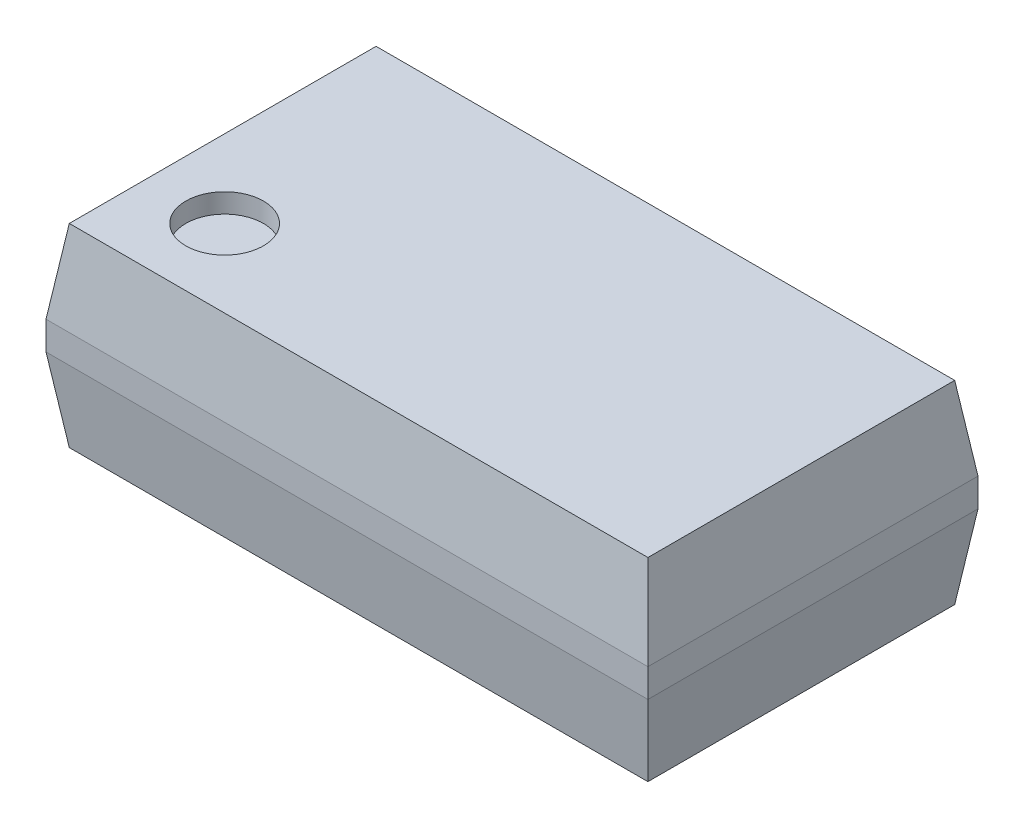
ISO-10303-21;
HEADER;
FILE_DESCRIPTION(('STEP AP214'),'2;1');
FILE_NAME('part.step','',(''),(''),'','','');
FILE_SCHEMA(('AUTOMOTIVE_DESIGN { 1 0 10303 214 1 1 1 1 }'));
ENDSEC;
DATA;
#1=APPLICATION_CONTEXT('core data for automotive mechanical design processes');
#2=APPLICATION_PROTOCOL_DEFINITION('international standard','automotive_design',2000,#1);
#3=PRODUCT_CONTEXT('',#1,'mechanical');
#4=PRODUCT('Part','Part','',(#3));
#5=PRODUCT_RELATED_PRODUCT_CATEGORY('part','',(#4));
#6=PRODUCT_DEFINITION_FORMATION('','',#4);
#7=PRODUCT_DEFINITION_CONTEXT('part definition',#1,'design');
#8=PRODUCT_DEFINITION('design','',#6,#7);
#9=PRODUCT_DEFINITION_SHAPE('','',#8);
#10=(LENGTH_UNIT() NAMED_UNIT(*) SI_UNIT(.MILLI.,.METRE.));
#11=(NAMED_UNIT(*) PLANE_ANGLE_UNIT() SI_UNIT($,.RADIAN.));
#12=(NAMED_UNIT(*) SI_UNIT($,.STERADIAN.) SOLID_ANGLE_UNIT());
#13=UNCERTAINTY_MEASURE_WITH_UNIT(LENGTH_MEASURE(1.E-05),#10,'distance_accuracy_value','');
#14=(GEOMETRIC_REPRESENTATION_CONTEXT(3) GLOBAL_UNCERTAINTY_ASSIGNED_CONTEXT((#13)) GLOBAL_UNIT_ASSIGNED_CONTEXT((#10,
#11,#12)) REPRESENTATION_CONTEXT('',''));
#15=CARTESIAN_POINT('',(0.,0.,0.));
#16=DIRECTION('',(0.,0.,1.));
#17=DIRECTION('',(1.,0.,0.));
#18=AXIS2_PLACEMENT_3D('',#15,#16,#17);
#19=CARTESIAN_POINT('',(-2.64,0.9,1.24));
#20=DIRECTION('',(0.,1.,0.));
#21=DIRECTION('',(-1.,0.,0.));
#22=AXIS2_PLACEMENT_3D('',#19,#20,#21);
#23=PLANE('',#22);
#24=CARTESIAN_POINT('',(-2.64,0.9,1.24));
#25=DIRECTION('',(0.,1.,0.));
#26=DIRECTION('',(-1.,0.,0.));
#27=AXIS2_PLACEMENT_3D('',#24,#25,#26);
#28=CIRCLE('',#27,0.2);
#29=CARTESIAN_POINT('',(-2.84,0.9,1.24));
#30=VERTEX_POINT('',#29);
#31=EDGE_CURVE('E20',#30,#30,#28,.T.);
#32=ORIENTED_EDGE('',*,*,#31,.T.);
#33=EDGE_LOOP('',(#32));
#34=FACE_BOUND('',#33,.T.);
#35=ADVANCED_FACE('F17',(#34),#23,.T.);
#36=CARTESIAN_POINT('',(-2.64,0.9,1.24));
#37=DIRECTION('',(0.,1.,0.));
#38=DIRECTION('',(-1.,0.,0.));
#39=AXIS2_PLACEMENT_3D('',#36,#37,#38);
#40=CYLINDRICAL_SURFACE('',#39,0.2);
#41=ORIENTED_EDGE('',*,*,#31,.F.);
#42=EDGE_LOOP('',(#41));
#43=FACE_BOUND('',#42,.T.);
#44=CARTESIAN_POINT('',(-2.64,1.,1.24));
#45=DIRECTION('',(0.,1.,0.));
#46=DIRECTION('',(-1.,0.,0.));
#47=AXIS2_PLACEMENT_3D('',#44,#45,#46);
#48=CIRCLE('',#47,0.2);
#49=CARTESIAN_POINT('',(-2.84,1.,1.24));
#50=VERTEX_POINT('',#49);
#51=EDGE_CURVE('E107',#50,#50,#48,.T.);
#52=ORIENTED_EDGE('',*,*,#51,.T.);
#53=EDGE_LOOP('',(#52));
#54=FACE_BOUND('',#53,.T.);
#55=ADVANCED_FACE('F115',(#43,#54),#40,.F.);
#56=CARTESIAN_POINT('',(0.,1.,1.7));
#57=DIRECTION('',(0.,-1.,0.));
#58=DIRECTION('',(1.,0.,0.));
#59=AXIS2_PLACEMENT_3D('',#56,#57,#58);
#60=PLANE('',#59);
#61=DIRECTION('',(1.,0.,0.));
#62=VECTOR('',#61,1.);
#63=CARTESIAN_POINT('',(0.,1.,0.0600000000000002));
#64=LINE('',#63,#62);
#65=CARTESIAN_POINT('',(-0.0600000000000003,1.,0.0599999999999999));
#66=VERTEX_POINT('',#65);
#67=CARTESIAN_POINT('',(-3.04,1.,0.0599999999999999));
#68=VERTEX_POINT('',#67);
#69=EDGE_CURVE('E83',#66,#68,#64,.F.);
#70=ORIENTED_EDGE('',*,*,#69,.T.);
#71=DIRECTION('',(0.,0.,1.));
#72=VECTOR('',#71,1.);
#73=CARTESIAN_POINT('',(-3.04,0.999999999999999,1.7));
#74=LINE('',#73,#72);
#75=CARTESIAN_POINT('',(-3.04,1.,1.64));
#76=VERTEX_POINT('',#75);
#77=EDGE_CURVE('E80',#68,#76,#74,.T.);
#78=ORIENTED_EDGE('',*,*,#77,.T.);
#79=DIRECTION('',(1.,0.,0.));
#80=VECTOR('',#79,1.);
#81=CARTESIAN_POINT('',(0.,1.,1.64));
#82=LINE('',#81,#80);
#83=CARTESIAN_POINT('',(-0.0600000000000003,1.,1.64));
#84=VERTEX_POINT('',#83);
#85=EDGE_CURVE('E280',#84,#76,#82,.F.);
#86=ORIENTED_EDGE('',*,*,#85,.F.);
#87=DIRECTION('',(0.,0.,1.));
#88=VECTOR('',#87,1.);
#89=CARTESIAN_POINT('',(-0.0600000000000002,1.,1.7));
#90=LINE('',#89,#88);
#91=EDGE_CURVE('E86',#66,#84,#90,.T.);
#92=ORIENTED_EDGE('',*,*,#91,.F.);
#93=EDGE_LOOP('',(#70,#78,#86,#92));
#94=FACE_BOUND('',#93,.T.);
#95=ORIENTED_EDGE('',*,*,#51,.F.);
#96=EDGE_LOOP('',(#95));
#97=FACE_BOUND('',#96,.T.);
#98=ADVANCED_FACE('F84',(#94,#97),#60,.F.);
#99=CARTESIAN_POINT('',(0.,1.,0.0600000000000002));
#100=DIRECTION('',(0.,-0.139173100960066,0.99026806874157));
#101=DIRECTION('',(0.,-0.99026806874157,-0.139173100960066));
#102=AXIS2_PLACEMENT_3D('',#99,#100,#101);
#103=PLANE('',#102);
#104=DIRECTION('',(1.,0.,0.));
#105=VECTOR('',#104,1.);
#106=CARTESIAN_POINT('',(0.,0.573077816656949,0.));
#107=LINE('',#106,#105);
#108=CARTESIAN_POINT('',(0.,0.573077816656949,0.));
#109=VERTEX_POINT('',#108);
#110=CARTESIAN_POINT('',(-3.1,0.573077816656949,0.));
#111=VERTEX_POINT('',#110);
#112=EDGE_CURVE('E102',#109,#111,#107,.F.);
#113=ORIENTED_EDGE('',*,*,#112,.T.);
#114=DIRECTION('',(0.137844537491629,0.980814848463989,0.137844537491629));
#115=VECTOR('',#114,1.);
#116=CARTESIAN_POINT('',(-3.1,0.573077816656949,0.));
#117=LINE('',#116,#115);
#118=EDGE_CURVE('E91',#111,#68,#117,.T.);
#119=ORIENTED_EDGE('',*,*,#118,.T.);
#120=ORIENTED_EDGE('',*,*,#69,.F.);
#121=DIRECTION('',(0.13784453749163,-0.980814848463989,-0.137844537491629));
#122=VECTOR('',#121,1.);
#123=CARTESIAN_POINT('',(-0.0600000000000002,1.,0.0599999999999993));
#124=LINE('',#123,#122);
#125=EDGE_CURVE('E286',#66,#109,#124,.T.);
#126=ORIENTED_EDGE('',*,*,#125,.T.);
#127=EDGE_LOOP('',(#113,#119,#120,#126));
#128=FACE_BOUND('',#127,.T.);
#129=ADVANCED_FACE('F101',(#128),#103,.F.);
#130=CARTESIAN_POINT('',(-3.1,0.573077816656949,1.7));
#131=DIRECTION('',(0.99026806874157,-0.139173100960066,0.));
#132=DIRECTION('',(0.139173100960066,0.99026806874157,0.));
#133=AXIS2_PLACEMENT_3D('',#130,#131,#132);
#134=PLANE('',#133);
#135=ORIENTED_EDGE('',*,*,#77,.F.);
#136=ORIENTED_EDGE('',*,*,#118,.F.);
#137=DIRECTION('',(0.,0.,-1.));
#138=VECTOR('',#137,1.);
#139=CARTESIAN_POINT('',(-3.1,0.573077816656949,1.7));
#140=LINE('',#139,#138);
#141=CARTESIAN_POINT('',(-3.1,0.573077816656949,1.7));
#142=VERTEX_POINT('',#141);
#143=EDGE_CURVE('E288',#111,#142,#140,.F.);
#144=ORIENTED_EDGE('',*,*,#143,.T.);
#145=DIRECTION('',(-0.13784453749163,-0.980814848463989,0.137844537491629));
#146=VECTOR('',#145,1.);
#147=CARTESIAN_POINT('',(-3.04,0.999999999999999,1.64));
#148=LINE('',#147,#146);
#149=EDGE_CURVE('E98',#76,#142,#148,.T.);
#150=ORIENTED_EDGE('',*,*,#149,.F.);
#151=EDGE_LOOP('',(#135,#136,#144,#150));
#152=FACE_BOUND('',#151,.T.);
#153=ADVANCED_FACE('F95',(#152),#134,.F.);
#154=CARTESIAN_POINT('',(0.,0.573077816656949,1.7));
#155=DIRECTION('',(0.,0.139173100960066,0.99026806874157));
#156=DIRECTION('',(0.,-0.99026806874157,0.139173100960066));
#157=AXIS2_PLACEMENT_3D('',#154,#155,#156);
#158=PLANE('',#157);
#159=DIRECTION('',(-0.13784453749163,0.980814848463989,-0.137844537491629));
#160=VECTOR('',#159,1.);
#161=CARTESIAN_POINT('',(0.,0.573077816656949,1.7));
#162=LINE('',#161,#160);
#163=CARTESIAN_POINT('',(0.,0.573077816656949,1.7));
#164=VERTEX_POINT('',#163);
#165=EDGE_CURVE('E279',#164,#84,#162,.T.);
#166=ORIENTED_EDGE('',*,*,#165,.T.);
#167=ORIENTED_EDGE('',*,*,#85,.T.);
#168=ORIENTED_EDGE('',*,*,#149,.T.);
#169=DIRECTION('',(1.,0.,0.));
#170=VECTOR('',#169,1.);
#171=CARTESIAN_POINT('',(0.,0.573077816656949,1.7));
#172=LINE('',#171,#170);
#173=EDGE_CURVE('E282',#164,#142,#172,.F.);
#174=ORIENTED_EDGE('',*,*,#173,.F.);
#175=EDGE_LOOP('',(#166,#167,#168,#174));
#176=FACE_BOUND('',#175,.T.);
#177=ADVANCED_FACE('F165',(#176),#158,.T.);
#178=CARTESIAN_POINT('',(-0.0600000000000002,1.,1.7));
#179=DIRECTION('',(-0.99026806874157,-0.139173100960067,0.));
#180=DIRECTION('',(0.139173100960067,-0.99026806874157,0.));
#181=AXIS2_PLACEMENT_3D('',#178,#179,#180);
#182=PLANE('',#181);
#183=DIRECTION('',(0.,0.,1.));
#184=VECTOR('',#183,1.);
#185=CARTESIAN_POINT('',(0.,0.573077816656949,1.7));
#186=LINE('',#185,#184);
#187=EDGE_CURVE('E299',#164,#109,#186,.F.);
#188=ORIENTED_EDGE('',*,*,#187,.T.);
#189=ORIENTED_EDGE('',*,*,#125,.F.);
#190=ORIENTED_EDGE('',*,*,#91,.T.);
#191=ORIENTED_EDGE('',*,*,#165,.F.);
#192=EDGE_LOOP('',(#188,#189,#190,#191));
#193=FACE_BOUND('',#192,.T.);
#194=ADVANCED_FACE('F161',(#193),#182,.F.);
#195=CARTESIAN_POINT('',(0.,0.,0.));
#196=DIRECTION('',(0.,0.,1.));
#197=DIRECTION('',(1.,0.,0.));
#198=AXIS2_PLACEMENT_3D('',#195,#196,#197);
#199=PLANE('',#198);
#200=DIRECTION('',(1.,0.,0.));
#201=VECTOR('',#200,1.);
#202=CARTESIAN_POINT('',(0.,0.426922183343052,0.));
#203=LINE('',#202,#201);
#204=CARTESIAN_POINT('',(0.,0.426922183343052,0.));
#205=VERTEX_POINT('',#204);
#206=CARTESIAN_POINT('',(-3.1,0.426922183343052,0.));
#207=VERTEX_POINT('',#206);
#208=EDGE_CURVE('E312',#205,#207,#203,.F.);
#209=ORIENTED_EDGE('',*,*,#208,.T.);
#210=DIRECTION('',(0.,1.,0.));
#211=VECTOR('',#210,1.);
#212=CARTESIAN_POINT('',(-3.1,0.,0.));
#213=LINE('',#212,#211);
#214=EDGE_CURVE('E294',#207,#111,#213,.T.);
#215=ORIENTED_EDGE('',*,*,#214,.T.);
#216=ORIENTED_EDGE('',*,*,#112,.F.);
#217=DIRECTION('',(0.,-1.,0.));
#218=VECTOR('',#217,1.);
#219=CARTESIAN_POINT('',(0.,0.,0.));
#220=LINE('',#219,#218);
#221=EDGE_CURVE('E308',#109,#205,#220,.T.);
#222=ORIENTED_EDGE('',*,*,#221,.T.);
#223=EDGE_LOOP('',(#209,#215,#216,#222));
#224=FACE_BOUND('',#223,.T.);
#225=ADVANCED_FACE('F157',(#224),#199,.F.);
#226=CARTESIAN_POINT('',(-3.1,0.,1.7));
#227=DIRECTION('',(1.,0.,0.));
#228=DIRECTION('',(0.,0.,-1.));
#229=AXIS2_PLACEMENT_3D('',#226,#227,#228);
#230=PLANE('',#229);
#231=DIRECTION('',(0.,0.,1.));
#232=VECTOR('',#231,1.);
#233=CARTESIAN_POINT('',(-3.1,0.426922183343052,1.7));
#234=LINE('',#233,#232);
#235=CARTESIAN_POINT('',(-3.1,0.426922183343052,1.7));
#236=VERTEX_POINT('',#235);
#237=EDGE_CURVE('E302',#207,#236,#234,.T.);
#238=ORIENTED_EDGE('',*,*,#237,.T.);
#239=DIRECTION('',(0.,1.,0.));
#240=VECTOR('',#239,1.);
#241=CARTESIAN_POINT('',(-3.1,0.,1.7));
#242=LINE('',#241,#240);
#243=EDGE_CURVE('E296',#142,#236,#242,.F.);
#244=ORIENTED_EDGE('',*,*,#243,.F.);
#245=ORIENTED_EDGE('',*,*,#143,.F.);
#246=ORIENTED_EDGE('',*,*,#214,.F.);
#247=EDGE_LOOP('',(#238,#244,#245,#246));
#248=FACE_BOUND('',#247,.T.);
#249=ADVANCED_FACE('F153',(#248),#230,.F.);
#250=CARTESIAN_POINT('',(0.,0.,1.7));
#251=DIRECTION('',(0.,0.,1.));
#252=DIRECTION('',(1.,0.,0.));
#253=AXIS2_PLACEMENT_3D('',#250,#251,#252);
#254=PLANE('',#253);
#255=DIRECTION('',(0.,-1.,0.));
#256=VECTOR('',#255,1.);
#257=CARTESIAN_POINT('',(0.,0.,1.7));
#258=LINE('',#257,#256);
#259=CARTESIAN_POINT('',(0.,0.426922183343052,1.7));
#260=VERTEX_POINT('',#259);
#261=EDGE_CURVE('E298',#260,#164,#258,.F.);
#262=ORIENTED_EDGE('',*,*,#261,.T.);
#263=ORIENTED_EDGE('',*,*,#173,.T.);
#264=ORIENTED_EDGE('',*,*,#243,.T.);
#265=DIRECTION('',(1.,0.,0.));
#266=VECTOR('',#265,1.);
#267=CARTESIAN_POINT('',(0.,0.426922183343052,1.7));
#268=LINE('',#267,#266);
#269=EDGE_CURVE('E321',#260,#236,#268,.F.);
#270=ORIENTED_EDGE('',*,*,#269,.F.);
#271=EDGE_LOOP('',(#262,#263,#264,#270));
#272=FACE_BOUND('',#271,.T.);
#273=ADVANCED_FACE('F149',(#272),#254,.T.);
#274=CARTESIAN_POINT('',(0.,0.,1.7));
#275=DIRECTION('',(-1.,0.,0.));
#276=DIRECTION('',(0.,-1.,0.));
#277=AXIS2_PLACEMENT_3D('',#274,#275,#276);
#278=PLANE('',#277);
#279=DIRECTION('',(0.,0.,1.));
#280=VECTOR('',#279,1.);
#281=CARTESIAN_POINT('',(0.,0.426922183343052,1.7));
#282=LINE('',#281,#280);
#283=EDGE_CURVE('E324',#260,#205,#282,.F.);
#284=ORIENTED_EDGE('',*,*,#283,.T.);
#285=ORIENTED_EDGE('',*,*,#221,.F.);
#286=ORIENTED_EDGE('',*,*,#187,.F.);
#287=ORIENTED_EDGE('',*,*,#261,.F.);
#288=EDGE_LOOP('',(#284,#285,#286,#287));
#289=FACE_BOUND('',#288,.T.);
#290=ADVANCED_FACE('F145',(#289),#278,.F.);
#291=CARTESIAN_POINT('',(0.,0.,0.0599999999999999));
#292=DIRECTION('',(0.,0.139173100960065,0.99026806874157));
#293=DIRECTION('',(0.,-0.99026806874157,0.139173100960065));
#294=AXIS2_PLACEMENT_3D('',#291,#292,#293);
#295=PLANE('',#294);
#296=DIRECTION('',(-1.,0.,0.));
#297=VECTOR('',#296,1.);
#298=CARTESIAN_POINT('',(0.,0.,0.0599999999999999));
#299=LINE('',#298,#297);
#300=CARTESIAN_POINT('',(-0.06,0.,0.0599999999999998));
#301=VERTEX_POINT('',#300);
#302=CARTESIAN_POINT('',(-3.04,0.,0.0599999999999999));
#303=VERTEX_POINT('',#302);
#304=EDGE_CURVE('E330',#301,#303,#299,.T.);
#305=ORIENTED_EDGE('',*,*,#304,.T.);
#306=DIRECTION('',(-0.137844537491629,0.980814848463989,-0.137844537491628));
#307=VECTOR('',#306,1.);
#308=CARTESIAN_POINT('',(-3.04,0.,0.0599999999999999));
#309=LINE('',#308,#307);
#310=EDGE_CURVE('E316',#303,#207,#309,.T.);
#311=ORIENTED_EDGE('',*,*,#310,.T.);
#312=ORIENTED_EDGE('',*,*,#208,.F.);
#313=DIRECTION('',(-0.137844537491629,-0.980814848463989,0.137844537491629));
#314=VECTOR('',#313,1.);
#315=CARTESIAN_POINT('',(0.,0.426922183343052,0.));
#316=LINE('',#315,#314);
#317=EDGE_CURVE('E327',#205,#301,#316,.T.);
#318=ORIENTED_EDGE('',*,*,#317,.T.);
#319=EDGE_LOOP('',(#305,#311,#312,#318));
#320=FACE_BOUND('',#319,.T.);
#321=ADVANCED_FACE('F141',(#320),#295,.F.);
#322=CARTESIAN_POINT('',(-3.04,0.,1.7));
#323=DIRECTION('',(0.99026806874157,0.139173100960066,0.));
#324=DIRECTION('',(-0.139173100960066,0.99026806874157,0.));
#325=AXIS2_PLACEMENT_3D('',#322,#323,#324);
#326=PLANE('',#325);
#327=DIRECTION('',(0.,0.,1.));
#328=VECTOR('',#327,1.);
#329=CARTESIAN_POINT('',(-3.04,0.,1.7));
#330=LINE('',#329,#328);
#331=CARTESIAN_POINT('',(-3.04,0.,1.64));
#332=VERTEX_POINT('',#331);
#333=EDGE_CURVE('E333',#303,#332,#330,.T.);
#334=ORIENTED_EDGE('',*,*,#333,.T.);
#335=DIRECTION('',(0.13784453749163,-0.980814848463989,-0.137844537491629));
#336=VECTOR('',#335,1.);
#337=CARTESIAN_POINT('',(-3.1,0.426922183343052,1.7));
#338=LINE('',#337,#336);
#339=EDGE_CURVE('E319',#236,#332,#338,.T.);
#340=ORIENTED_EDGE('',*,*,#339,.F.);
#341=ORIENTED_EDGE('',*,*,#237,.F.);
#342=ORIENTED_EDGE('',*,*,#310,.F.);
#343=EDGE_LOOP('',(#334,#340,#341,#342));
#344=FACE_BOUND('',#343,.T.);
#345=ADVANCED_FACE('F137',(#344),#326,.F.);
#346=CARTESIAN_POINT('',(0.,0.426922183343052,1.7));
#347=DIRECTION('',(0.,-0.139173100960065,0.99026806874157));
#348=DIRECTION('',(0.,-0.99026806874157,-0.139173100960065));
#349=AXIS2_PLACEMENT_3D('',#346,#347,#348);
#350=PLANE('',#349);
#351=DIRECTION('',(0.137844537491629,0.980814848463989,0.137844537491629));
#352=VECTOR('',#351,1.);
#353=CARTESIAN_POINT('',(-0.06,0.,1.64));
#354=LINE('',#353,#352);
#355=CARTESIAN_POINT('',(-0.06,0.,1.64));
#356=VERTEX_POINT('',#355);
#357=EDGE_CURVE('E34',#356,#260,#354,.T.);
#358=ORIENTED_EDGE('',*,*,#357,.T.);
#359=ORIENTED_EDGE('',*,*,#269,.T.);
#360=ORIENTED_EDGE('',*,*,#339,.T.);
#361=DIRECTION('',(-1.,0.,0.));
#362=VECTOR('',#361,1.);
#363=CARTESIAN_POINT('',(0.,0.,1.64));
#364=LINE('',#363,#362);
#365=EDGE_CURVE('E26',#332,#356,#364,.F.);
#366=ORIENTED_EDGE('',*,*,#365,.T.);
#367=EDGE_LOOP('',(#358,#359,#360,#366));
#368=FACE_BOUND('',#367,.T.);
#369=ADVANCED_FACE('F131',(#368),#350,.T.);
#370=CARTESIAN_POINT('',(0.,0.426922183343052,1.7));
#371=DIRECTION('',(-0.99026806874157,0.139173100960065,0.));
#372=DIRECTION('',(-0.139173100960065,-0.99026806874157,0.));
#373=AXIS2_PLACEMENT_3D('',#370,#371,#372);
#374=PLANE('',#373);
#375=ORIENTED_EDGE('',*,*,#283,.F.);
#376=ORIENTED_EDGE('',*,*,#357,.F.);
#377=DIRECTION('',(0.,0.,1.));
#378=VECTOR('',#377,1.);
#379=CARTESIAN_POINT('',(-0.06,0.,1.7));
#380=LINE('',#379,#378);
#381=EDGE_CURVE('E11',#356,#301,#380,.F.);
#382=ORIENTED_EDGE('',*,*,#381,.T.);
#383=ORIENTED_EDGE('',*,*,#317,.F.);
#384=EDGE_LOOP('',(#375,#376,#382,#383));
#385=FACE_BOUND('',#384,.T.);
#386=ADVANCED_FACE('F125',(#385),#374,.F.);
#387=CARTESIAN_POINT('',(0.,0.,1.7));
#388=DIRECTION('',(0.,1.,0.));
#389=DIRECTION('',(-1.,0.,0.));
#390=AXIS2_PLACEMENT_3D('',#387,#388,#389);
#391=PLANE('',#390);
#392=ORIENTED_EDGE('',*,*,#365,.F.);
#393=ORIENTED_EDGE('',*,*,#333,.F.);
#394=ORIENTED_EDGE('',*,*,#304,.F.);
#395=ORIENTED_EDGE('',*,*,#381,.F.);
#396=EDGE_LOOP('',(#392,#393,#394,#395));
#397=FACE_BOUND('',#396,.T.);
#398=ADVANCED_FACE('F123',(#397),#391,.F.);
#399=CLOSED_SHELL('',(#35,#55,#98,#129,#153,#177,#194,#225,#249,#273,#290,#321,#345,#369,#386,#398));
#400=MANIFOLD_SOLID_BREP('B1',#399);
#401=ADVANCED_BREP_SHAPE_REPRESENTATION('',(#18,#400),#14);
#402=SHAPE_DEFINITION_REPRESENTATION(#9,#401);
ENDSEC;
END-ISO-10303-21;
